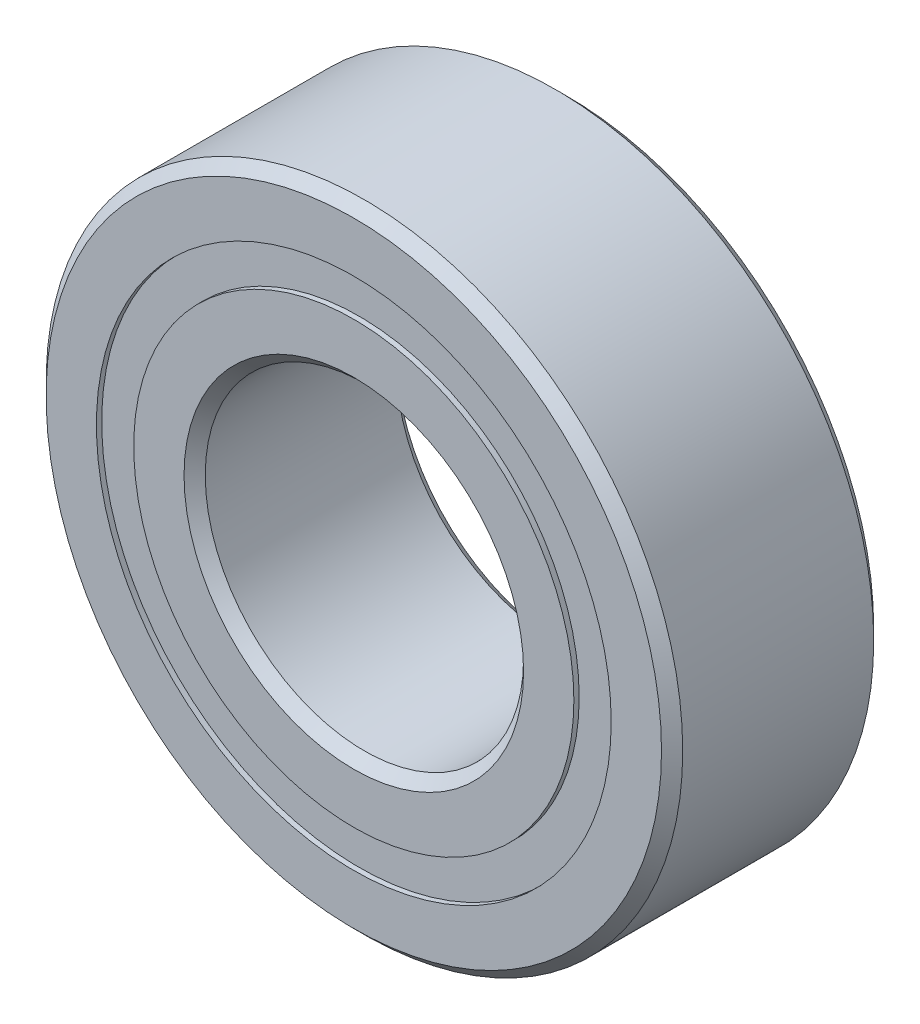
ISO-10303-21;
HEADER;
FILE_DESCRIPTION(('STEP AP214'),'2;1');
FILE_NAME('part.step','',(''),(''),'','','');
FILE_SCHEMA(('AUTOMOTIVE_DESIGN { 1 0 10303 214 1 1 1 1 }'));
ENDSEC;
DATA;
#1=APPLICATION_CONTEXT('core data for automotive mechanical design processes');
#2=APPLICATION_PROTOCOL_DEFINITION('international standard','automotive_design',2000,#1);
#3=PRODUCT_CONTEXT('',#1,'mechanical');
#4=PRODUCT('Part','Part','',(#3));
#5=PRODUCT_RELATED_PRODUCT_CATEGORY('part','',(#4));
#6=PRODUCT_DEFINITION_FORMATION('','',#4);
#7=PRODUCT_DEFINITION_CONTEXT('part definition',#1,'design');
#8=PRODUCT_DEFINITION('design','',#6,#7);
#9=PRODUCT_DEFINITION_SHAPE('','',#8);
#10=(LENGTH_UNIT() NAMED_UNIT(*) SI_UNIT(.MILLI.,.METRE.));
#11=(NAMED_UNIT(*) PLANE_ANGLE_UNIT() SI_UNIT($,.RADIAN.));
#12=(NAMED_UNIT(*) SI_UNIT($,.STERADIAN.) SOLID_ANGLE_UNIT());
#13=UNCERTAINTY_MEASURE_WITH_UNIT(LENGTH_MEASURE(1.E-05),#10,'distance_accuracy_value','');
#14=(GEOMETRIC_REPRESENTATION_CONTEXT(3) GLOBAL_UNCERTAINTY_ASSIGNED_CONTEXT((#13)) GLOBAL_UNIT_ASSIGNED_CONTEXT((#10,
#11,#12)) REPRESENTATION_CONTEXT('',''));
#15=CARTESIAN_POINT('',(0.,0.,0.));
#16=DIRECTION('',(0.,0.,1.));
#17=DIRECTION('',(1.,0.,0.));
#18=AXIS2_PLACEMENT_3D('',#15,#16,#17);
#19=CARTESIAN_POINT('',(0.,3.85099587912088,-1.508125));
#20=DIRECTION('',(0.,0.,1.));
#21=DIRECTION('',(1.,0.,0.));
#22=AXIS2_PLACEMENT_3D('',#19,#20,#21);
#23=PLANE('',#22);
#24=CARTESIAN_POINT('',(0.,0.,-1.508125));
#25=DIRECTION('',(0.,0.,1.));
#26=DIRECTION('',(1.,0.,0.));
#27=AXIS2_PLACEMENT_3D('',#24,#25,#26);
#28=CIRCLE('',#27,3.85099587912088);
#29=CARTESIAN_POINT('',(3.85099587912088,0.,-1.508125));
#30=VERTEX_POINT('',#29);
#31=EDGE_CURVE('E72',#30,#30,#28,.T.);
#32=ORIENTED_EDGE('',*,*,#31,.F.);
#33=EDGE_LOOP('',(#32));
#34=FACE_BOUND('',#33,.T.);
#35=CARTESIAN_POINT('',(0.,0.,-1.508125));
#36=DIRECTION('',(0.,0.,1.));
#37=DIRECTION('',(1.,0.,0.));
#38=AXIS2_PLACEMENT_3D('',#35,#36,#37);
#39=CIRCLE('',#38,3.29275412087912);
#40=CARTESIAN_POINT('',(3.29275412087912,0.,-1.508125));
#41=VERTEX_POINT('',#40);
#42=EDGE_CURVE('E11',#41,#41,#39,.T.);
#43=ORIENTED_EDGE('',*,*,#42,.T.);
#44=EDGE_LOOP('',(#43));
#45=FACE_BOUND('',#44,.T.);
#46=ADVANCED_FACE('F58',(#34,#45),#23,.F.);
#47=CARTESIAN_POINT('',(0.,0.,1.5875));
#48=DIRECTION('',(0.,0.,1.));
#49=DIRECTION('',(1.,0.,0.));
#50=AXIS2_PLACEMENT_3D('',#47,#48,#49);
#51=CYLINDRICAL_SURFACE('',#50,3.29275412087912);
#52=ORIENTED_EDGE('',*,*,#42,.F.);
#53=EDGE_LOOP('',(#52));
#54=FACE_BOUND('',#53,.T.);
#55=CARTESIAN_POINT('',(0.,0.,-0.758760243513405));
#56=DIRECTION('',(0.,0.,1.));
#57=DIRECTION('',(1.,0.,0.));
#58=AXIS2_PLACEMENT_3D('',#55,#56,#57);
#59=CIRCLE('',#58,3.29275412087912);
#60=CARTESIAN_POINT('',(3.29275412087912,0.,-0.758760243513405));
#61=VERTEX_POINT('',#60);
#62=EDGE_CURVE('E64',#61,#61,#59,.T.);
#63=ORIENTED_EDGE('',*,*,#62,.T.);
#64=EDGE_LOOP('',(#63));
#65=FACE_BOUND('',#64,.T.);
#66=ADVANCED_FACE('F81',(#54,#65),#51,.F.);
#67=CARTESIAN_POINT('',(0.,3.85099587912088,-0.758760243513405));
#68=DIRECTION('',(0.,0.,-1.));
#69=DIRECTION('',(-1.,0.,0.));
#70=AXIS2_PLACEMENT_3D('',#67,#68,#69);
#71=PLANE('',#70);
#72=ORIENTED_EDGE('',*,*,#62,.F.);
#73=EDGE_LOOP('',(#72));
#74=FACE_BOUND('',#73,.T.);
#75=CARTESIAN_POINT('',(0.,0.,-0.758760243513405));
#76=DIRECTION('',(0.,0.,1.));
#77=DIRECTION('',(1.,0.,0.));
#78=AXIS2_PLACEMENT_3D('',#75,#76,#77);
#79=CIRCLE('',#78,3.85099587912088);
#80=CARTESIAN_POINT('',(3.85099587912088,0.,-0.758760243513405));
#81=VERTEX_POINT('',#80);
#82=EDGE_CURVE('E68',#81,#81,#79,.T.);
#83=ORIENTED_EDGE('',*,*,#82,.T.);
#84=EDGE_LOOP('',(#83));
#85=FACE_BOUND('',#84,.T.);
#86=ADVANCED_FACE('F85',(#74,#85),#71,.F.);
#87=CARTESIAN_POINT('',(0.,0.,1.5875));
#88=DIRECTION('',(0.,0.,1.));
#89=DIRECTION('',(1.,0.,0.));
#90=AXIS2_PLACEMENT_3D('',#87,#88,#89);
#91=CYLINDRICAL_SURFACE('',#90,3.85099587912088);
#92=ORIENTED_EDGE('',*,*,#82,.F.);
#93=EDGE_LOOP('',(#92));
#94=FACE_BOUND('',#93,.T.);
#95=ORIENTED_EDGE('',*,*,#31,.T.);
#96=EDGE_LOOP('',(#95));
#97=FACE_BOUND('',#96,.T.);
#98=ADVANCED_FACE('F78',(#94,#97),#91,.T.);
#99=CLOSED_SHELL('',(#46,#66,#86,#98));
#100=MANIFOLD_SOLID_BREP('B2',#99);
#101=CARTESIAN_POINT('',(0.,3.85099587912088,1.508125));
#102=DIRECTION('',(0.,0.,-1.));
#103=DIRECTION('',(-1.,0.,0.));
#104=AXIS2_PLACEMENT_3D('',#101,#102,#103);
#105=PLANE('',#104);
#106=CARTESIAN_POINT('',(0.,0.,1.508125));
#107=DIRECTION('',(0.,0.,1.));
#108=DIRECTION('',(1.,0.,0.));
#109=AXIS2_PLACEMENT_3D('',#106,#107,#108);
#110=CIRCLE('',#109,3.29275412087912);
#111=CARTESIAN_POINT('',(3.29275412087912,0.,1.508125));
#112=VERTEX_POINT('',#111);
#113=EDGE_CURVE('E57',#112,#112,#110,.T.);
#114=ORIENTED_EDGE('',*,*,#113,.F.);
#115=EDGE_LOOP('',(#114));
#116=FACE_BOUND('',#115,.T.);
#117=CARTESIAN_POINT('',(0.,0.,1.508125));
#118=DIRECTION('',(0.,0.,1.));
#119=DIRECTION('',(1.,0.,0.));
#120=AXIS2_PLACEMENT_3D('',#117,#118,#119);
#121=CIRCLE('',#120,3.85099587912088);
#122=CARTESIAN_POINT('',(3.85099587912088,0.,1.508125));
#123=VERTEX_POINT('',#122);
#124=EDGE_CURVE('E140',#123,#123,#121,.T.);
#125=ORIENTED_EDGE('',*,*,#124,.T.);
#126=EDGE_LOOP('',(#125));
#127=FACE_BOUND('',#126,.T.);
#128=ADVANCED_FACE('F126',(#116,#127),#105,.F.);
#129=CARTESIAN_POINT('',(0.,0.,1.5875));
#130=DIRECTION('',(0.,0.,1.));
#131=DIRECTION('',(1.,0.,0.));
#132=AXIS2_PLACEMENT_3D('',#129,#130,#131);
#133=CYLINDRICAL_SURFACE('',#132,3.29275412087912);
#134=CARTESIAN_POINT('',(0.,0.,0.758760243513404));
#135=DIRECTION('',(0.,0.,1.));
#136=DIRECTION('',(1.,0.,0.));
#137=AXIS2_PLACEMENT_3D('',#134,#135,#136);
#138=CIRCLE('',#137,3.29275412087912);
#139=CARTESIAN_POINT('',(3.29275412087912,0.,0.758760243513404));
#140=VERTEX_POINT('',#139);
#141=EDGE_CURVE('E132',#140,#140,#138,.T.);
#142=ORIENTED_EDGE('',*,*,#141,.F.);
#143=EDGE_LOOP('',(#142));
#144=FACE_BOUND('',#143,.T.);
#145=ORIENTED_EDGE('',*,*,#113,.T.);
#146=EDGE_LOOP('',(#145));
#147=FACE_BOUND('',#146,.T.);
#148=ADVANCED_FACE('F155',(#144,#147),#133,.F.);
#149=CARTESIAN_POINT('',(0.,3.85099587912088,0.758760243513404));
#150=DIRECTION('',(0.,0.,1.));
#151=DIRECTION('',(1.,0.,0.));
#152=AXIS2_PLACEMENT_3D('',#149,#150,#151);
#153=PLANE('',#152);
#154=CARTESIAN_POINT('',(0.,0.,0.758760243513404));
#155=DIRECTION('',(0.,0.,1.));
#156=DIRECTION('',(1.,0.,0.));
#157=AXIS2_PLACEMENT_3D('',#154,#155,#156);
#158=CIRCLE('',#157,3.85099587912088);
#159=CARTESIAN_POINT('',(3.85099587912088,0.,0.758760243513404));
#160=VERTEX_POINT('',#159);
#161=EDGE_CURVE('E136',#160,#160,#158,.T.);
#162=ORIENTED_EDGE('',*,*,#161,.F.);
#163=EDGE_LOOP('',(#162));
#164=FACE_BOUND('',#163,.T.);
#165=ORIENTED_EDGE('',*,*,#141,.T.);
#166=EDGE_LOOP('',(#165));
#167=FACE_BOUND('',#166,.T.);
#168=ADVANCED_FACE('F150',(#164,#167),#153,.F.);
#169=CARTESIAN_POINT('',(0.,0.,1.5875));
#170=DIRECTION('',(0.,0.,1.));
#171=DIRECTION('',(1.,0.,0.));
#172=AXIS2_PLACEMENT_3D('',#169,#170,#171);
#173=CYLINDRICAL_SURFACE('',#172,3.85099587912088);
#174=ORIENTED_EDGE('',*,*,#124,.F.);
#175=EDGE_LOOP('',(#174));
#176=FACE_BOUND('',#175,.T.);
#177=ORIENTED_EDGE('',*,*,#161,.T.);
#178=EDGE_LOOP('',(#177));
#179=FACE_BOUND('',#178,.T.);
#180=ADVANCED_FACE('F147',(#176,#179),#173,.T.);
#181=CLOSED_SHELL('',(#128,#148,#168,#180));
#182=MANIFOLD_SOLID_BREP('B6',#181);
#183=CARTESIAN_POINT('',(-1.78593749999996,3.09333448914257,0.));
#184=DIRECTION('',(0.,0.,1.));
#185=DIRECTION('',(-0.499999999999989,0.866025403784445,0.));
#186=AXIS2_PLACEMENT_3D('',#183,#184,#185);
#187=SPHERICAL_SURFACE('',#186,0.758760243513404);
#188=CARTESIAN_POINT('',(-1.78593749999996,3.09333448914257,0.758760243513404));
#189=VERTEX_POINT('',#188);
#190=VERTEX_LOOP('',#189);
#191=FACE_BOUND('',#190,.T.);
#192=ADVANCED_FACE('F194',(#191),#187,.T.);
#193=CLOSED_SHELL('',(#192));
#194=MANIFOLD_SOLID_BREP('B52',#193);
#195=CARTESIAN_POINT('',(-3.09333448914252,1.78593750000004,0.));
#196=DIRECTION('',(0.,0.,1.));
#197=DIRECTION('',(-0.866025403784433,0.50000000000001,0.));
#198=AXIS2_PLACEMENT_3D('',#195,#196,#197);
#199=SPHERICAL_SURFACE('',#198,0.758760243513404);
#200=CARTESIAN_POINT('',(-3.09333448914252,1.78593750000004,0.758760243513404));
#201=VERTEX_POINT('',#200);
#202=VERTEX_LOOP('',#201);
#203=FACE_BOUND('',#202,.T.);
#204=ADVANCED_FACE('F219',(#203),#199,.T.);
#205=CLOSED_SHELL('',(#204));
#206=MANIFOLD_SOLID_BREP('B122',#205);
#207=CARTESIAN_POINT('',(-3.571875,0.,0.));
#208=DIRECTION('',(0.,0.,1.));
#209=DIRECTION('',(-1.,0.,0.));
#210=AXIS2_PLACEMENT_3D('',#207,#208,#209);
#211=SPHERICAL_SURFACE('',#210,0.758760243513404);
#212=CARTESIAN_POINT('',(-3.571875,0.,0.758760243513404));
#213=VERTEX_POINT('',#212);
#214=VERTEX_LOOP('',#213);
#215=FACE_BOUND('',#214,.T.);
#216=ADVANCED_FACE('F244',(#215),#211,.T.);
#217=CLOSED_SHELL('',(#216));
#218=MANIFOLD_SOLID_BREP('B190',#217);
#219=CARTESIAN_POINT('',(-3.09333448914256,-1.78593749999997,0.));
#220=DIRECTION('',(0.,0.,1.));
#221=DIRECTION('',(-0.866025403784443,-0.499999999999992,0.));
#222=AXIS2_PLACEMENT_3D('',#219,#220,#221);
#223=SPHERICAL_SURFACE('',#222,0.758760243513404);
#224=CARTESIAN_POINT('',(-3.09333448914256,-1.78593749999997,0.758760243513404));
#225=VERTEX_POINT('',#224);
#226=VERTEX_LOOP('',#225);
#227=FACE_BOUND('',#226,.T.);
#228=ADVANCED_FACE('F269',(#227),#223,.T.);
#229=CLOSED_SHELL('',(#228));
#230=MANIFOLD_SOLID_BREP('B215',#229);
#231=CARTESIAN_POINT('',(-1.78593750000003,-3.09333448914253,0.));
#232=DIRECTION('',(0.,0.,1.));
#233=DIRECTION('',(-0.500000000000007,-0.866025403784435,0.));
#234=AXIS2_PLACEMENT_3D('',#231,#232,#233);
#235=SPHERICAL_SURFACE('',#234,0.758760243513404);
#236=CARTESIAN_POINT('',(-1.78593750000003,-3.09333448914253,0.758760243513404));
#237=VERTEX_POINT('',#236);
#238=VERTEX_LOOP('',#237);
#239=FACE_BOUND('',#238,.T.);
#240=ADVANCED_FACE('F294',(#239),#235,.T.);
#241=CLOSED_SHELL('',(#240));
#242=MANIFOLD_SOLID_BREP('B240',#241);
#243=CARTESIAN_POINT('',(0.,-3.571875,0.));
#244=DIRECTION('',(0.,0.,1.));
#245=DIRECTION('',(0.,-1.,0.));
#246=AXIS2_PLACEMENT_3D('',#243,#244,#245);
#247=SPHERICAL_SURFACE('',#246,0.758760243513404);
#248=CARTESIAN_POINT('',(0.,-3.571875,0.758760243513404));
#249=VERTEX_POINT('',#248);
#250=VERTEX_LOOP('',#249);
#251=FACE_BOUND('',#250,.T.);
#252=ADVANCED_FACE('F319',(#251),#247,.T.);
#253=CLOSED_SHELL('',(#252));
#254=MANIFOLD_SOLID_BREP('B265',#253);
#255=CARTESIAN_POINT('',(1.78593749999998,-3.09333448914255,0.));
#256=DIRECTION('',(0.,0.,1.));
#257=DIRECTION('',(0.499999999999995,-0.866025403784442,0.));
#258=AXIS2_PLACEMENT_3D('',#255,#256,#257);
#259=SPHERICAL_SURFACE('',#258,0.758760243513404);
#260=CARTESIAN_POINT('',(1.78593749999998,-3.09333448914255,0.758760243513404));
#261=VERTEX_POINT('',#260);
#262=VERTEX_LOOP('',#261);
#263=FACE_BOUND('',#262,.T.);
#264=ADVANCED_FACE('F344',(#263),#259,.T.);
#265=CLOSED_SHELL('',(#264));
#266=MANIFOLD_SOLID_BREP('B290',#265);
#267=CARTESIAN_POINT('',(3.09333448914253,-1.78593750000001,0.));
#268=DIRECTION('',(0.,0.,1.));
#269=DIRECTION('',(0.866025403784436,-0.500000000000004,0.));
#270=AXIS2_PLACEMENT_3D('',#267,#268,#269);
#271=SPHERICAL_SURFACE('',#270,0.758760243513404);
#272=CARTESIAN_POINT('',(3.09333448914253,-1.78593750000001,0.758760243513404));
#273=VERTEX_POINT('',#272);
#274=VERTEX_LOOP('',#273);
#275=FACE_BOUND('',#274,.T.);
#276=ADVANCED_FACE('F369',(#275),#271,.T.);
#277=CLOSED_SHELL('',(#276));
#278=MANIFOLD_SOLID_BREP('B315',#277);
#279=CARTESIAN_POINT('',(3.571875,0.,0.));
#280=DIRECTION('',(0.,0.,1.));
#281=DIRECTION('',(1.,0.,0.));
#282=AXIS2_PLACEMENT_3D('',#279,#280,#281);
#283=SPHERICAL_SURFACE('',#282,0.758760243513404);
#284=CARTESIAN_POINT('',(3.571875,0.,0.758760243513404));
#285=VERTEX_POINT('',#284);
#286=VERTEX_LOOP('',#285);
#287=FACE_BOUND('',#286,.T.);
#288=ADVANCED_FACE('F394',(#287),#283,.T.);
#289=CLOSED_SHELL('',(#288));
#290=MANIFOLD_SOLID_BREP('B340',#289);
#291=CARTESIAN_POINT('',(3.09333448914255,1.78593749999999,0.));
#292=DIRECTION('',(0.,0.,1.));
#293=DIRECTION('',(0.86602540378444,0.499999999999998,0.));
#294=AXIS2_PLACEMENT_3D('',#291,#292,#293);
#295=SPHERICAL_SURFACE('',#294,0.758760243513404);
#296=CARTESIAN_POINT('',(3.09333448914255,1.78593749999999,0.758760243513404));
#297=VERTEX_POINT('',#296);
#298=VERTEX_LOOP('',#297);
#299=FACE_BOUND('',#298,.T.);
#300=ADVANCED_FACE('F419',(#299),#295,.T.);
#301=CLOSED_SHELL('',(#300));
#302=MANIFOLD_SOLID_BREP('B365',#301);
#303=CARTESIAN_POINT('',(1.7859375,3.09333448914254,0.));
#304=DIRECTION('',(0.,0.,1.));
#305=DIRECTION('',(0.500000000000001,0.866025403784438,0.));
#306=AXIS2_PLACEMENT_3D('',#303,#304,#305);
#307=SPHERICAL_SURFACE('',#306,0.758760243513404);
#308=CARTESIAN_POINT('',(1.7859375,3.09333448914254,0.758760243513404));
#309=VERTEX_POINT('',#308);
#310=VERTEX_LOOP('',#309);
#311=FACE_BOUND('',#310,.T.);
#312=ADVANCED_FACE('F444',(#311),#307,.T.);
#313=CLOSED_SHELL('',(#312));
#314=MANIFOLD_SOLID_BREP('B390',#313);
#315=CARTESIAN_POINT('',(0.,3.571875,0.));
#316=DIRECTION('',(0.,0.,1.));
#317=DIRECTION('',(0.,1.,0.));
#318=AXIS2_PLACEMENT_3D('',#315,#316,#317);
#319=SPHERICAL_SURFACE('',#318,0.758760243513404);
#320=CARTESIAN_POINT('',(0.,3.571875,0.758760243513404));
#321=VERTEX_POINT('',#320);
#322=VERTEX_LOOP('',#321);
#323=FACE_BOUND('',#322,.T.);
#324=ADVANCED_FACE('F471',(#323),#319,.T.);
#325=CLOSED_SHELL('',(#324));
#326=MANIFOLD_SOLID_BREP('B415',#325);
#327=CARTESIAN_POINT('',(0.,3.29275412087912,1.5875));
#328=DIRECTION('',(0.,0.,-1.));
#329=DIRECTION('',(-1.,0.,0.));
#330=AXIS2_PLACEMENT_3D('',#327,#328,#329);
#331=PLANE('',#330);
#332=CARTESIAN_POINT('',(0.,0.,1.5875));
#333=DIRECTION('',(0.,0.,1.));
#334=DIRECTION('',(1.,0.,0.));
#335=AXIS2_PLACEMENT_3D('',#332,#333,#334);
#336=CIRCLE('',#335,2.54);
#337=CARTESIAN_POINT('',(2.54,0.,1.5875));
#338=VERTEX_POINT('',#337);
#339=EDGE_CURVE('E519',#338,#338,#336,.T.);
#340=ORIENTED_EDGE('',*,*,#339,.F.);
#341=EDGE_LOOP('',(#340));
#342=FACE_BOUND('',#341,.T.);
#343=CARTESIAN_POINT('',(0.,0.,1.5875));
#344=DIRECTION('',(0.,0.,1.));
#345=DIRECTION('',(1.,0.,0.));
#346=AXIS2_PLACEMENT_3D('',#343,#344,#345);
#347=CIRCLE('',#346,3.29275412087912);
#348=CARTESIAN_POINT('',(3.29275412087912,0.,1.5875));
#349=VERTEX_POINT('',#348);
#350=EDGE_CURVE('E470',#349,#349,#347,.T.);
#351=ORIENTED_EDGE('',*,*,#350,.T.);
#352=EDGE_LOOP('',(#351));
#353=FACE_BOUND('',#352,.T.);
#354=ADVANCED_FACE('F491',(#342,#353),#331,.F.);
#355=CARTESIAN_POINT('',(0.,0.,1.5875));
#356=DIRECTION('',(0.,0.,1.));
#357=DIRECTION('',(1.,0.,0.));
#358=AXIS2_PLACEMENT_3D('',#355,#356,#357);
#359=CYLINDRICAL_SURFACE('',#358,3.29275412087912);
#360=ORIENTED_EDGE('',*,*,#350,.F.);
#361=EDGE_LOOP('',(#360));
#362=FACE_BOUND('',#361,.T.);
#363=CARTESIAN_POINT('',(0.,0.,0.705555555555556));
#364=DIRECTION('',(0.,0.,1.));
#365=DIRECTION('',(1.,0.,0.));
#366=AXIS2_PLACEMENT_3D('',#363,#364,#365);
#367=CIRCLE('',#366,3.29275412087912);
#368=CARTESIAN_POINT('',(3.29275412087912,0.,0.705555555555556));
#369=VERTEX_POINT('',#368);
#370=EDGE_CURVE('E497',#369,#369,#367,.T.);
#371=ORIENTED_EDGE('',*,*,#370,.T.);
#372=EDGE_LOOP('',(#371));
#373=FACE_BOUND('',#372,.T.);
#374=ADVANCED_FACE('F526',(#362,#373),#359,.T.);
#375=CARTESIAN_POINT('',(0.,0.,0.));
#376=DIRECTION('',(0.,0.,1.));
#377=DIRECTION('',(1.,0.,0.));
#378=AXIS2_PLACEMENT_3D('',#375,#376,#377);
#379=TOROIDAL_SURFACE('',#378,3.57187499999999,0.758760243513403);
#380=ORIENTED_EDGE('',*,*,#370,.F.);
#381=EDGE_LOOP('',(#380));
#382=FACE_BOUND('',#381,.T.);
#383=CARTESIAN_POINT('',(0.,0.,-0.705555555555557));
#384=DIRECTION('',(0.,0.,1.));
#385=DIRECTION('',(1.,0.,0.));
#386=AXIS2_PLACEMENT_3D('',#383,#384,#385);
#387=CIRCLE('',#386,3.29275412087912);
#388=CARTESIAN_POINT('',(3.29275412087912,0.,-0.705555555555557));
#389=VERTEX_POINT('',#388);
#390=EDGE_CURVE('E501',#389,#389,#387,.T.);
#391=ORIENTED_EDGE('',*,*,#390,.T.);
#392=EDGE_LOOP('',(#391));
#393=FACE_BOUND('',#392,.T.);
#394=ADVANCED_FACE('F530',(#382,#393),#379,.F.);
#395=CARTESIAN_POINT('',(0.,0.,1.5875));
#396=DIRECTION('',(0.,0.,1.));
#397=DIRECTION('',(1.,0.,0.));
#398=AXIS2_PLACEMENT_3D('',#395,#396,#397);
#399=CYLINDRICAL_SURFACE('',#398,3.29275412087912);
#400=ORIENTED_EDGE('',*,*,#390,.F.);
#401=EDGE_LOOP('',(#400));
#402=FACE_BOUND('',#401,.T.);
#403=CARTESIAN_POINT('',(0.,0.,-1.5875));
#404=DIRECTION('',(0.,0.,1.));
#405=DIRECTION('',(1.,0.,0.));
#406=AXIS2_PLACEMENT_3D('',#403,#404,#405);
#407=CIRCLE('',#406,3.29275412087912);
#408=CARTESIAN_POINT('',(3.29275412087912,0.,-1.5875));
#409=VERTEX_POINT('',#408);
#410=EDGE_CURVE('E505',#409,#409,#407,.T.);
#411=ORIENTED_EDGE('',*,*,#410,.T.);
#412=EDGE_LOOP('',(#411));
#413=FACE_BOUND('',#412,.T.);
#414=ADVANCED_FACE('F535',(#402,#413),#399,.T.);
#415=CARTESIAN_POINT('',(0.,2.54,-1.5875));
#416=DIRECTION('',(0.,0.,1.));
#417=DIRECTION('',(1.,0.,0.));
#418=AXIS2_PLACEMENT_3D('',#415,#416,#417);
#419=PLANE('',#418);
#420=ORIENTED_EDGE('',*,*,#410,.F.);
#421=EDGE_LOOP('',(#420));
#422=FACE_BOUND('',#421,.T.);
#423=CARTESIAN_POINT('',(0.,0.,-1.5875));
#424=DIRECTION('',(0.,0.,1.));
#425=DIRECTION('',(1.,0.,0.));
#426=AXIS2_PLACEMENT_3D('',#423,#424,#425);
#427=CIRCLE('',#426,2.54);
#428=CARTESIAN_POINT('',(2.54,0.,-1.5875));
#429=VERTEX_POINT('',#428);
#430=EDGE_CURVE('E510',#429,#429,#427,.T.);
#431=ORIENTED_EDGE('',*,*,#430,.T.);
#432=EDGE_LOOP('',(#431));
#433=FACE_BOUND('',#432,.T.);
#434=ADVANCED_FACE('F541',(#422,#433),#419,.F.);
#435=CARTESIAN_POINT('',(0.,0.,-1.42875));
#436=DIRECTION('',(0.,0.,-1.));
#437=DIRECTION('',(-1.,0.,0.));
#438=AXIS2_PLACEMENT_3D('',#435,#436,#437);
#439=CONICAL_SURFACE('',#438,2.38125,0.785398163397447);
#440=ORIENTED_EDGE('',*,*,#430,.F.);
#441=EDGE_LOOP('',(#440));
#442=FACE_BOUND('',#441,.T.);
#443=CARTESIAN_POINT('',(0.,0.,-1.42875));
#444=DIRECTION('',(0.,0.,1.));
#445=DIRECTION('',(1.,0.,0.));
#446=AXIS2_PLACEMENT_3D('',#443,#444,#445);
#447=CIRCLE('',#446,2.38125);
#448=CARTESIAN_POINT('',(2.38125,0.,-1.42875));
#449=VERTEX_POINT('',#448);
#450=EDGE_CURVE('E513',#449,#449,#447,.T.);
#451=ORIENTED_EDGE('',*,*,#450,.T.);
#452=EDGE_LOOP('',(#451));
#453=FACE_BOUND('',#452,.T.);
#454=ADVANCED_FACE('F545',(#442,#453),#439,.F.);
#455=CARTESIAN_POINT('',(0.,0.,1.5875));
#456=DIRECTION('',(0.,0.,1.));
#457=DIRECTION('',(1.,0.,0.));
#458=AXIS2_PLACEMENT_3D('',#455,#456,#457);
#459=CYLINDRICAL_SURFACE('',#458,2.38125);
#460=ORIENTED_EDGE('',*,*,#450,.F.);
#461=EDGE_LOOP('',(#460));
#462=FACE_BOUND('',#461,.T.);
#463=CARTESIAN_POINT('',(0.,0.,1.42875));
#464=DIRECTION('',(0.,0.,1.));
#465=DIRECTION('',(1.,0.,0.));
#466=AXIS2_PLACEMENT_3D('',#463,#464,#465);
#467=CIRCLE('',#466,2.38125);
#468=CARTESIAN_POINT('',(2.38125,0.,1.42875));
#469=VERTEX_POINT('',#468);
#470=EDGE_CURVE('E516',#469,#469,#467,.T.);
#471=ORIENTED_EDGE('',*,*,#470,.T.);
#472=EDGE_LOOP('',(#471));
#473=FACE_BOUND('',#472,.T.);
#474=ADVANCED_FACE('F549',(#462,#473),#459,.F.);
#475=CARTESIAN_POINT('',(0.,0.,1.5875));
#476=DIRECTION('',(0.,0.,1.));
#477=DIRECTION('',(1.,0.,0.));
#478=AXIS2_PLACEMENT_3D('',#475,#476,#477);
#479=CONICAL_SURFACE('',#478,2.54,0.785398163397448);
#480=ORIENTED_EDGE('',*,*,#470,.F.);
#481=EDGE_LOOP('',(#480));
#482=FACE_BOUND('',#481,.T.);
#483=ORIENTED_EDGE('',*,*,#339,.T.);
#484=EDGE_LOOP('',(#483));
#485=FACE_BOUND('',#484,.T.);
#486=ADVANCED_FACE('F523',(#482,#485),#479,.F.);
#487=CLOSED_SHELL('',(#354,#374,#394,#414,#434,#454,#474,#486));
#488=MANIFOLD_SOLID_BREP('B440',#487);
#489=CARTESIAN_POINT('',(0.,0.,1.42875));
#490=DIRECTION('',(0.,0.,-1.));
#491=DIRECTION('',(-1.,0.,0.));
#492=AXIS2_PLACEMENT_3D('',#489,#490,#491);
#493=CONICAL_SURFACE('',#492,4.7625,0.785398163397445);
#494=CARTESIAN_POINT('',(0.,0.,1.5875));
#495=DIRECTION('',(0.,0.,1.));
#496=DIRECTION('',(1.,0.,0.));
#497=AXIS2_PLACEMENT_3D('',#494,#495,#496);
#498=CIRCLE('',#497,4.60375);
#499=CARTESIAN_POINT('',(4.60375,0.,1.5875));
#500=VERTEX_POINT('',#499);
#501=EDGE_CURVE('E648',#500,#500,#498,.T.);
#502=ORIENTED_EDGE('',*,*,#501,.F.);
#503=EDGE_LOOP('',(#502));
#504=FACE_BOUND('',#503,.T.);
#505=CARTESIAN_POINT('',(0.,0.,1.42875));
#506=DIRECTION('',(0.,0.,1.));
#507=DIRECTION('',(1.,0.,0.));
#508=AXIS2_PLACEMENT_3D('',#505,#506,#507);
#509=CIRCLE('',#508,4.7625);
#510=CARTESIAN_POINT('',(4.7625,0.,1.42875));
#511=VERTEX_POINT('',#510);
#512=EDGE_CURVE('E490',#511,#511,#509,.T.);
#513=ORIENTED_EDGE('',*,*,#512,.T.);
#514=EDGE_LOOP('',(#513));
#515=FACE_BOUND('',#514,.T.);
#516=ADVANCED_FACE('F613',(#504,#515),#493,.T.);
#517=CARTESIAN_POINT('',(0.,0.,1.5875));
#518=DIRECTION('',(0.,0.,1.));
#519=DIRECTION('',(1.,0.,0.));
#520=AXIS2_PLACEMENT_3D('',#517,#518,#519);
#521=CYLINDRICAL_SURFACE('',#520,4.7625);
#522=ORIENTED_EDGE('',*,*,#512,.F.);
#523=EDGE_LOOP('',(#522));
#524=FACE_BOUND('',#523,.T.);
#525=CARTESIAN_POINT('',(0.,0.,-1.42875));
#526=DIRECTION('',(0.,0.,1.));
#527=DIRECTION('',(1.,0.,0.));
#528=AXIS2_PLACEMENT_3D('',#525,#526,#527);
#529=CIRCLE('',#528,4.7625);
#530=CARTESIAN_POINT('',(4.7625,0.,-1.42875));
#531=VERTEX_POINT('',#530);
#532=EDGE_CURVE('E620',#531,#531,#529,.T.);
#533=ORIENTED_EDGE('',*,*,#532,.T.);
#534=EDGE_LOOP('',(#533));
#535=FACE_BOUND('',#534,.T.);
#536=ADVANCED_FACE('F656',(#524,#535),#521,.T.);
#537=CARTESIAN_POINT('',(0.,0.,-1.5875));
#538=DIRECTION('',(0.,0.,1.));
#539=DIRECTION('',(1.,0.,0.));
#540=AXIS2_PLACEMENT_3D('',#537,#538,#539);
#541=CONICAL_SURFACE('',#540,4.60375,0.785398163397444);
#542=ORIENTED_EDGE('',*,*,#532,.F.);
#543=EDGE_LOOP('',(#542));
#544=FACE_BOUND('',#543,.T.);
#545=CARTESIAN_POINT('',(0.,0.,-1.5875));
#546=DIRECTION('',(0.,0.,1.));
#547=DIRECTION('',(1.,0.,0.));
#548=AXIS2_PLACEMENT_3D('',#545,#546,#547);
#549=CIRCLE('',#548,4.60375);
#550=CARTESIAN_POINT('',(4.60375,0.,-1.5875));
#551=VERTEX_POINT('',#550);
#552=EDGE_CURVE('E625',#551,#551,#549,.T.);
#553=ORIENTED_EDGE('',*,*,#552,.T.);
#554=EDGE_LOOP('',(#553));
#555=FACE_BOUND('',#554,.T.);
#556=ADVANCED_FACE('F660',(#544,#555),#541,.T.);
#557=CARTESIAN_POINT('',(0.,4.60375,-1.5875));
#558=DIRECTION('',(0.,0.,1.));
#559=DIRECTION('',(1.,0.,0.));
#560=AXIS2_PLACEMENT_3D('',#557,#558,#559);
#561=PLANE('',#560);
#562=ORIENTED_EDGE('',*,*,#552,.F.);
#563=EDGE_LOOP('',(#562));
#564=FACE_BOUND('',#563,.T.);
#565=CARTESIAN_POINT('',(0.,0.,-1.5875));
#566=DIRECTION('',(0.,0.,1.));
#567=DIRECTION('',(1.,0.,0.));
#568=AXIS2_PLACEMENT_3D('',#565,#566,#567);
#569=CIRCLE('',#568,3.85099587912088);
#570=CARTESIAN_POINT('',(3.85099587912088,0.,-1.5875));
#571=VERTEX_POINT('',#570);
#572=EDGE_CURVE('E630',#571,#571,#569,.T.);
#573=ORIENTED_EDGE('',*,*,#572,.T.);
#574=EDGE_LOOP('',(#573));
#575=FACE_BOUND('',#574,.T.);
#576=ADVANCED_FACE('F665',(#564,#575),#561,.F.);
#577=CARTESIAN_POINT('',(0.,0.,1.5875));
#578=DIRECTION('',(0.,0.,1.));
#579=DIRECTION('',(1.,0.,0.));
#580=AXIS2_PLACEMENT_3D('',#577,#578,#579);
#581=CYLINDRICAL_SURFACE('',#580,3.85099587912088);
#582=ORIENTED_EDGE('',*,*,#572,.F.);
#583=EDGE_LOOP('',(#582));
#584=FACE_BOUND('',#583,.T.);
#585=CARTESIAN_POINT('',(0.,0.,-0.705555555555556));
#586=DIRECTION('',(0.,0.,1.));
#587=DIRECTION('',(1.,0.,0.));
#588=AXIS2_PLACEMENT_3D('',#585,#586,#587);
#589=CIRCLE('',#588,3.85099587912088);
#590=CARTESIAN_POINT('',(3.85099587912088,0.,-0.705555555555556));
#591=VERTEX_POINT('',#590);
#592=EDGE_CURVE('E636',#591,#591,#589,.T.);
#593=ORIENTED_EDGE('',*,*,#592,.T.);
#594=EDGE_LOOP('',(#593));
#595=FACE_BOUND('',#594,.T.);
#596=ADVANCED_FACE('F671',(#584,#595),#581,.F.);
#597=CARTESIAN_POINT('',(0.,0.,0.));
#598=DIRECTION('',(0.,0.,1.));
#599=DIRECTION('',(1.,0.,0.));
#600=AXIS2_PLACEMENT_3D('',#597,#598,#599);
#601=TOROIDAL_SURFACE('',#600,3.571875,0.758760243513404);
#602=ORIENTED_EDGE('',*,*,#592,.F.);
#603=EDGE_LOOP('',(#602));
#604=FACE_BOUND('',#603,.T.);
#605=CARTESIAN_POINT('',(0.,0.,0.705555555555555));
#606=DIRECTION('',(0.,0.,1.));
#607=DIRECTION('',(1.,0.,0.));
#608=AXIS2_PLACEMENT_3D('',#605,#606,#607);
#609=CIRCLE('',#608,3.85099587912088);
#610=CARTESIAN_POINT('',(3.85099587912088,0.,0.705555555555555));
#611=VERTEX_POINT('',#610);
#612=EDGE_CURVE('E640',#611,#611,#609,.T.);
#613=ORIENTED_EDGE('',*,*,#612,.T.);
#614=EDGE_LOOP('',(#613));
#615=FACE_BOUND('',#614,.T.);
#616=ADVANCED_FACE('F675',(#604,#615),#601,.F.);
#617=CARTESIAN_POINT('',(0.,0.,1.5875));
#618=DIRECTION('',(0.,0.,1.));
#619=DIRECTION('',(1.,0.,0.));
#620=AXIS2_PLACEMENT_3D('',#617,#618,#619);
#621=CYLINDRICAL_SURFACE('',#620,3.85099587912088);
#622=ORIENTED_EDGE('',*,*,#612,.F.);
#623=EDGE_LOOP('',(#622));
#624=FACE_BOUND('',#623,.T.);
#625=CARTESIAN_POINT('',(0.,0.,1.5875));
#626=DIRECTION('',(0.,0.,1.));
#627=DIRECTION('',(1.,0.,0.));
#628=AXIS2_PLACEMENT_3D('',#625,#626,#627);
#629=CIRCLE('',#628,3.85099587912088);
#630=CARTESIAN_POINT('',(3.85099587912088,0.,1.5875));
#631=VERTEX_POINT('',#630);
#632=EDGE_CURVE('E644',#631,#631,#629,.T.);
#633=ORIENTED_EDGE('',*,*,#632,.T.);
#634=EDGE_LOOP('',(#633));
#635=FACE_BOUND('',#634,.T.);
#636=ADVANCED_FACE('F679',(#624,#635),#621,.F.);
#637=CARTESIAN_POINT('',(0.,4.60375,1.5875));
#638=DIRECTION('',(0.,0.,-1.));
#639=DIRECTION('',(-1.,0.,0.));
#640=AXIS2_PLACEMENT_3D('',#637,#638,#639);
#641=PLANE('',#640);
#642=ORIENTED_EDGE('',*,*,#632,.F.);
#643=EDGE_LOOP('',(#642));
#644=FACE_BOUND('',#643,.T.);
#645=ORIENTED_EDGE('',*,*,#501,.T.);
#646=EDGE_LOOP('',(#645));
#647=FACE_BOUND('',#646,.T.);
#648=ADVANCED_FACE('F653',(#644,#647),#641,.F.);
#649=CLOSED_SHELL('',(#516,#536,#556,#576,#596,#616,#636,#648));
#650=MANIFOLD_SOLID_BREP('B465',#649);
#651=ADVANCED_BREP_SHAPE_REPRESENTATION('',(#18,#100,#182,#194,#206,#218,#230,#242,#254,#266,
#278,#290,#302,#314,#326,#488,#650),#14);
#652=SHAPE_DEFINITION_REPRESENTATION(#9,#651);
ENDSEC;
END-ISO-10303-21;
